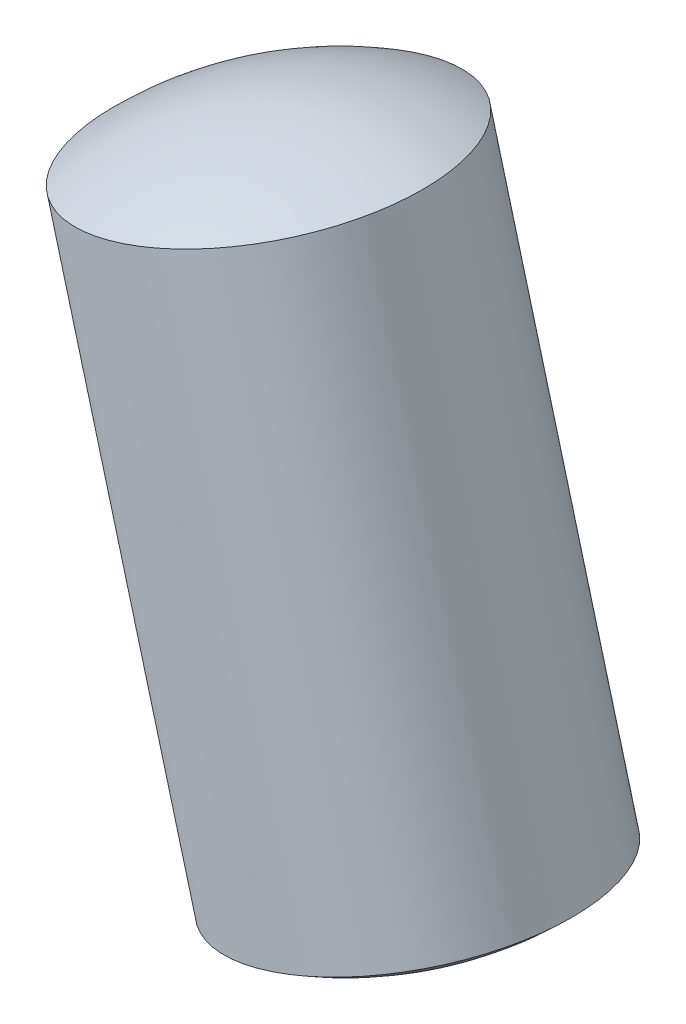
ISO-10303-21;
HEADER;
FILE_DESCRIPTION(('STEP AP214'),'2;1');
FILE_NAME('part.step','',(''),(''),'','','');
FILE_SCHEMA(('AUTOMOTIVE_DESIGN { 1 0 10303 214 1 1 1 1 }'));
ENDSEC;
DATA;
#1=APPLICATION_CONTEXT('core data for automotive mechanical design processes');
#2=APPLICATION_PROTOCOL_DEFINITION('international standard','automotive_design',2000,#1);
#3=PRODUCT_CONTEXT('',#1,'mechanical');
#4=PRODUCT('Part','Part','',(#3));
#5=PRODUCT_RELATED_PRODUCT_CATEGORY('part','',(#4));
#6=PRODUCT_DEFINITION_FORMATION('','',#4);
#7=PRODUCT_DEFINITION_CONTEXT('part definition',#1,'design');
#8=PRODUCT_DEFINITION('design','',#6,#7);
#9=PRODUCT_DEFINITION_SHAPE('','',#8);
#10=(LENGTH_UNIT() NAMED_UNIT(*) SI_UNIT(.MILLI.,.METRE.));
#11=(NAMED_UNIT(*) PLANE_ANGLE_UNIT() SI_UNIT($,.RADIAN.));
#12=(NAMED_UNIT(*) SI_UNIT($,.STERADIAN.) SOLID_ANGLE_UNIT());
#13=UNCERTAINTY_MEASURE_WITH_UNIT(LENGTH_MEASURE(1.E-05),#10,'distance_accuracy_value','');
#14=(GEOMETRIC_REPRESENTATION_CONTEXT(3) GLOBAL_UNCERTAINTY_ASSIGNED_CONTEXT((#13)) GLOBAL_UNIT_ASSIGNED_CONTEXT((#10,
#11,#12)) REPRESENTATION_CONTEXT('',''));
#15=CARTESIAN_POINT('',(0.,0.,0.));
#16=DIRECTION('',(0.,0.,1.));
#17=DIRECTION('',(1.,0.,0.));
#18=AXIS2_PLACEMENT_3D('',#15,#16,#17);
#19=CARTESIAN_POINT('',(7.1439035579701,-26.6614110427164,0.9));
#20=DIRECTION('',(-0.965925826289068,-0.258819045102521,0.));
#21=DIRECTION('',(0.258819045102522,-0.965925826289068,0.));
#22=AXIS2_PLACEMENT_3D('',#19,#20,#21);
#23=SPHERICAL_SURFACE('',#22,3.);
#24=CARTESIAN_POINT('',(7.1439035579701,-26.6614110427164,0.9));
#25=DIRECTION('',(-0.258819045102522,0.965925826289068,0.));
#26=DIRECTION('',(0.,0.,-1.));
#27=AXIS2_PLACEMENT_3D('',#24,#25,#26);
#28=SPHERICAL_SURFACE('',#27,3.);
#29=CARTESIAN_POINT('',(7.81633516209614,-29.17095995393,0.9));
#30=DIRECTION('',(-0.258819045102522,0.965925826289068,0.));
#31=DIRECTION('',(0.,0.,-1.));
#32=AXIS2_PLACEMENT_3D('',#29,#30,#31);
#33=CIRCLE('',#32,1.5);
#34=CARTESIAN_POINT('',(7.81633516209614,-29.17095995393,-0.6));
#35=VERTEX_POINT('',#34);
#36=EDGE_CURVE('E11',#35,#35,#33,.T.);
#37=ORIENTED_EDGE('',*,*,#36,.F.);
#38=EDGE_LOOP('',(#37));
#39=FACE_BOUND('',#38,.T.);
#40=ADVANCED_FACE('F17',(#39),#28,.T.);
#41=CARTESIAN_POINT('',(7.09114392266857,-26.4645094031823,0.9));
#42=DIRECTION('',(-0.965925826289068,-0.258819045102521,0.));
#43=DIRECTION('',(-0.258819045102522,0.965925826289068,0.));
#44=AXIS2_PLACEMENT_3D('',#41,#42,#43);
#45=SPHERICAL_SURFACE('',#44,3.);
#46=CARTESIAN_POINT('',(7.09114392266857,-26.4645094031823,0.9));
#47=DIRECTION('',(-0.258819045102522,0.965925826289068,0.));
#48=DIRECTION('',(0.,0.,-1.));
#49=AXIS2_PLACEMENT_3D('',#46,#47,#48);
#50=SPHERICAL_SURFACE('',#49,3.);
#51=CARTESIAN_POINT('',(6.41871231854252,-23.9549604919689,0.9));
#52=DIRECTION('',(-0.258819045102522,0.965925826289068,0.));
#53=DIRECTION('',(0.,0.,-1.));
#54=AXIS2_PLACEMENT_3D('',#51,#52,#53);
#55=CIRCLE('',#54,1.5);
#56=CARTESIAN_POINT('',(6.41871231854252,-23.9549604919689,-0.6));
#57=VERTEX_POINT('',#56);
#58=EDGE_CURVE('E21',#57,#57,#55,.T.);
#59=ORIENTED_EDGE('',*,*,#58,.T.);
#60=EDGE_LOOP('',(#59));
#61=FACE_BOUND('',#60,.T.);
#62=ADVANCED_FACE('F40',(#61),#50,.T.);
#63=CARTESIAN_POINT('',(6.76811802943093,-25.2589603574591,0.9));
#64=DIRECTION('',(-0.258819045102522,0.965925826289068,0.));
#65=DIRECTION('',(0.,0.,-1.));
#66=AXIS2_PLACEMENT_3D('',#63,#64,#65);
#67=CYLINDRICAL_SURFACE('',#66,1.5);
#68=ORIENTED_EDGE('',*,*,#36,.T.);
#69=EDGE_LOOP('',(#68));
#70=FACE_BOUND('',#69,.T.);
#71=ORIENTED_EDGE('',*,*,#58,.F.);
#72=EDGE_LOOP('',(#71));
#73=FACE_BOUND('',#72,.T.);
#74=ADVANCED_FACE('F19',(#70,#73),#67,.T.);
#75=CLOSED_SHELL('',(#40,#62,#74));
#76=MANIFOLD_SOLID_BREP('B1',#75);
#77=ADVANCED_BREP_SHAPE_REPRESENTATION('',(#18,#76),#14);
#78=SHAPE_DEFINITION_REPRESENTATION(#9,#77);
ENDSEC;
END-ISO-10303-21;
